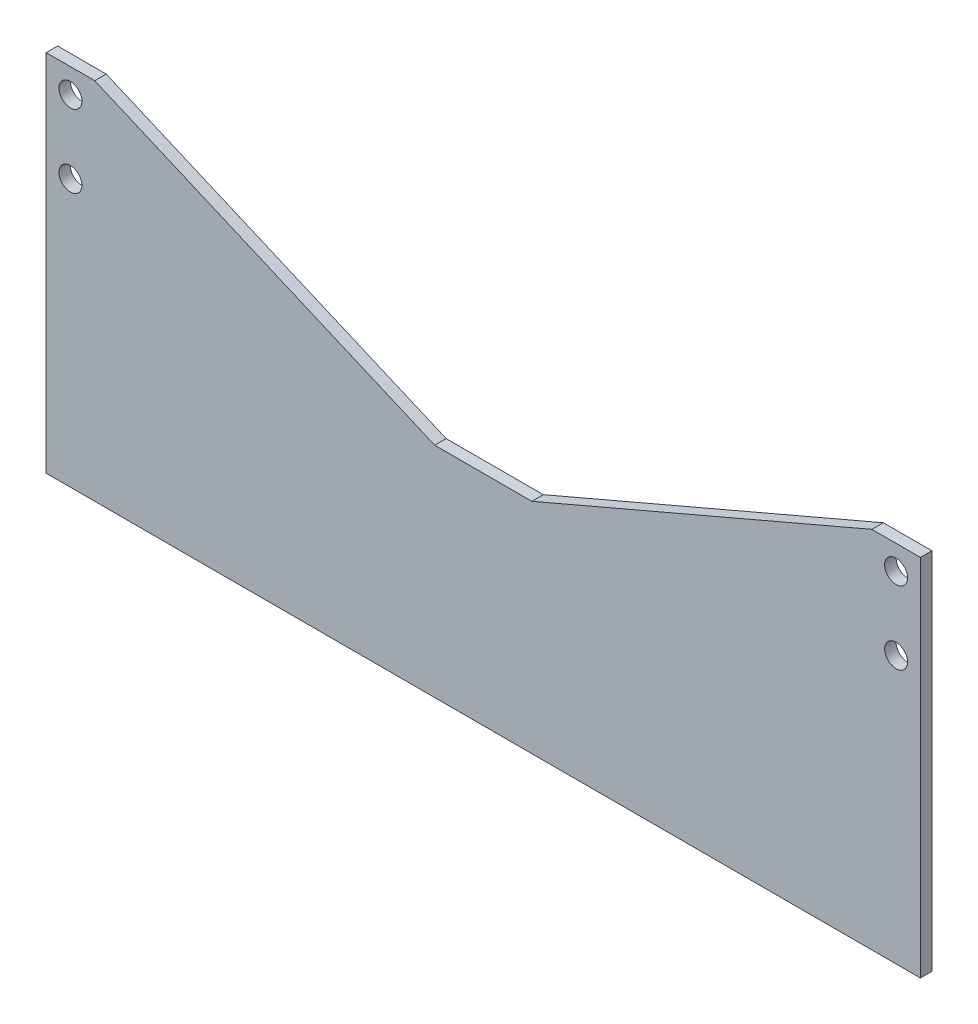
ISO-10303-21;
HEADER;
FILE_DESCRIPTION(('STEP AP214'),'2;1');
FILE_NAME('part.step','',(''),(''),'','','');
FILE_SCHEMA(('AUTOMOTIVE_DESIGN { 1 0 10303 214 1 1 1 1 }'));
ENDSEC;
DATA;
#1=APPLICATION_CONTEXT('core data for automotive mechanical design processes');
#2=APPLICATION_PROTOCOL_DEFINITION('international standard','automotive_design',2000,#1);
#3=PRODUCT_CONTEXT('',#1,'mechanical');
#4=PRODUCT('Part','Part','',(#3));
#5=PRODUCT_RELATED_PRODUCT_CATEGORY('part','',(#4));
#6=PRODUCT_DEFINITION_FORMATION('','',#4);
#7=PRODUCT_DEFINITION_CONTEXT('part definition',#1,'design');
#8=PRODUCT_DEFINITION('design','',#6,#7);
#9=PRODUCT_DEFINITION_SHAPE('','',#8);
#10=(LENGTH_UNIT() NAMED_UNIT(*) SI_UNIT(.MILLI.,.METRE.));
#11=(NAMED_UNIT(*) PLANE_ANGLE_UNIT() SI_UNIT($,.RADIAN.));
#12=(NAMED_UNIT(*) SI_UNIT($,.STERADIAN.) SOLID_ANGLE_UNIT());
#13=UNCERTAINTY_MEASURE_WITH_UNIT(LENGTH_MEASURE(1.E-05),#10,'distance_accuracy_value','');
#14=(GEOMETRIC_REPRESENTATION_CONTEXT(3) GLOBAL_UNCERTAINTY_ASSIGNED_CONTEXT((#13)) GLOBAL_UNIT_ASSIGNED_CONTEXT((#10,
#11,#12)) REPRESENTATION_CONTEXT('',''));
#15=CARTESIAN_POINT('',(0.,0.,0.));
#16=DIRECTION('',(0.,0.,1.));
#17=DIRECTION('',(1.,0.,0.));
#18=AXIS2_PLACEMENT_3D('',#15,#16,#17);
#19=CARTESIAN_POINT('',(0.,0.,0.75));
#20=DIRECTION('',(0.,0.,1.));
#21=DIRECTION('',(1.,0.,0.));
#22=AXIS2_PLACEMENT_3D('',#19,#20,#21);
#23=PLANE('',#22);
#24=CARTESIAN_POINT('',(-53.975,20.6375,0.75));
#25=DIRECTION('',(0.,0.,1.));
#26=DIRECTION('',(1.,0.,0.));
#27=AXIS2_PLACEMENT_3D('',#24,#25,#26);
#28=CIRCLE('',#27,1.5);
#29=CARTESIAN_POINT('',(-52.475,20.6375,0.75));
#30=VERTEX_POINT('',#29);
#31=EDGE_CURVE('E190',#30,#30,#28,.T.);
#32=ORIENTED_EDGE('',*,*,#31,.F.);
#33=EDGE_LOOP('',(#32));
#34=FACE_BOUND('',#33,.T.);
#35=CARTESIAN_POINT('',(53.975,20.6375,0.75));
#36=DIRECTION('',(0.,0.,1.));
#37=DIRECTION('',(1.,0.,0.));
#38=AXIS2_PLACEMENT_3D('',#35,#36,#37);
#39=CIRCLE('',#38,1.5);
#40=CARTESIAN_POINT('',(55.475,20.6375,0.75));
#41=VERTEX_POINT('',#40);
#42=EDGE_CURVE('E136',#41,#41,#39,.T.);
#43=ORIENTED_EDGE('',*,*,#42,.F.);
#44=EDGE_LOOP('',(#43));
#45=FACE_BOUND('',#44,.T.);
#46=DIRECTION('',(-1.,0.,0.));
#47=VECTOR('',#46,1.);
#48=CARTESIAN_POINT('',(50.8,23.8125,0.75));
#49=LINE('',#48,#47);
#50=CARTESIAN_POINT('',(57.15,23.8125,0.75));
#51=VERTEX_POINT('',#50);
#52=CARTESIAN_POINT('',(50.8,23.8125,0.75));
#53=VERTEX_POINT('',#52);
#54=EDGE_CURVE('E147',#51,#53,#49,.T.);
#55=ORIENTED_EDGE('',*,*,#54,.T.);
#56=DIRECTION('',(-0.919145030018058,-0.393919298579168,0.));
#57=VECTOR('',#56,1.);
#58=CARTESIAN_POINT('',(6.35,4.7625,0.75));
#59=LINE('',#58,#57);
#60=CARTESIAN_POINT('',(6.35,4.7625,0.75));
#61=VERTEX_POINT('',#60);
#62=EDGE_CURVE('E95',#53,#61,#59,.T.);
#63=ORIENTED_EDGE('',*,*,#62,.T.);
#64=DIRECTION('',(-1.,0.,0.));
#65=VECTOR('',#64,1.);
#66=CARTESIAN_POINT('',(-6.35,4.7625,0.75));
#67=LINE('',#66,#65);
#68=CARTESIAN_POINT('',(-6.35,4.7625,0.75));
#69=VERTEX_POINT('',#68);
#70=EDGE_CURVE('E162',#61,#69,#67,.T.);
#71=ORIENTED_EDGE('',*,*,#70,.T.);
#72=DIRECTION('',(-0.919145030018058,0.393919298579168,0.));
#73=VECTOR('',#72,1.);
#74=CARTESIAN_POINT('',(-6.35,4.7625,0.75));
#75=LINE('',#74,#73);
#76=CARTESIAN_POINT('',(-50.8,23.8125,0.75));
#77=VERTEX_POINT('',#76);
#78=EDGE_CURVE('E175',#69,#77,#75,.T.);
#79=ORIENTED_EDGE('',*,*,#78,.T.);
#80=DIRECTION('',(-1.,0.,0.));
#81=VECTOR('',#80,1.);
#82=CARTESIAN_POINT('',(-57.15,23.8125,0.75));
#83=LINE('',#82,#81);
#84=CARTESIAN_POINT('',(-57.15,23.8125,0.75));
#85=VERTEX_POINT('',#84);
#86=EDGE_CURVE('E114',#77,#85,#83,.T.);
#87=ORIENTED_EDGE('',*,*,#86,.T.);
#88=DIRECTION('',(0.,-1.,0.));
#89=VECTOR('',#88,1.);
#90=CARTESIAN_POINT('',(-57.15,-23.8125,0.75));
#91=LINE('',#90,#89);
#92=CARTESIAN_POINT('',(-57.15,-23.8125,0.75));
#93=VERTEX_POINT('',#92);
#94=EDGE_CURVE('E108',#85,#93,#91,.T.);
#95=ORIENTED_EDGE('',*,*,#94,.T.);
#96=DIRECTION('',(1.,0.,0.));
#97=VECTOR('',#96,1.);
#98=CARTESIAN_POINT('',(-57.15,-23.8125,0.75));
#99=LINE('',#98,#97);
#100=CARTESIAN_POINT('',(57.15,-23.8125,0.75));
#101=VERTEX_POINT('',#100);
#102=EDGE_CURVE('E112',#93,#101,#99,.T.);
#103=ORIENTED_EDGE('',*,*,#102,.T.);
#104=DIRECTION('',(0.,1.,0.));
#105=VECTOR('',#104,1.);
#106=CARTESIAN_POINT('',(57.15,-23.8125,0.75));
#107=LINE('',#106,#105);
#108=EDGE_CURVE('E52',#101,#51,#107,.T.);
#109=ORIENTED_EDGE('',*,*,#108,.T.);
#110=EDGE_LOOP('',(#55,#63,#71,#79,#87,#95,#103,#109));
#111=FACE_BOUND('',#110,.T.);
#112=CARTESIAN_POINT('',(53.975,11.1125,0.75));
#113=DIRECTION('',(0.,0.,1.));
#114=DIRECTION('',(1.,0.,0.));
#115=AXIS2_PLACEMENT_3D('',#112,#113,#114);
#116=CIRCLE('',#115,1.5);
#117=CARTESIAN_POINT('',(55.475,11.1125,0.75));
#118=VERTEX_POINT('',#117);
#119=EDGE_CURVE('E184',#118,#118,#116,.T.);
#120=ORIENTED_EDGE('',*,*,#119,.F.);
#121=EDGE_LOOP('',(#120));
#122=FACE_BOUND('',#121,.T.);
#123=CARTESIAN_POINT('',(-53.975,11.1125,0.75));
#124=DIRECTION('',(0.,0.,1.));
#125=DIRECTION('',(1.,0.,0.));
#126=AXIS2_PLACEMENT_3D('',#123,#124,#125);
#127=CIRCLE('',#126,1.5);
#128=CARTESIAN_POINT('',(-52.475,11.1125,0.75));
#129=VERTEX_POINT('',#128);
#130=EDGE_CURVE('E196',#129,#129,#127,.T.);
#131=ORIENTED_EDGE('',*,*,#130,.F.);
#132=EDGE_LOOP('',(#131));
#133=FACE_BOUND('',#132,.T.);
#134=ADVANCED_FACE('F35',(#34,#45,#111,#122,#133),#23,.T.);
#135=CARTESIAN_POINT('',(0.,0.,-0.75));
#136=DIRECTION('',(0.,0.,1.));
#137=DIRECTION('',(1.,0.,0.));
#138=AXIS2_PLACEMENT_3D('',#135,#136,#137);
#139=PLANE('',#138);
#140=DIRECTION('',(-1.,0.,0.));
#141=VECTOR('',#140,1.);
#142=CARTESIAN_POINT('',(50.8,23.8125,-0.75));
#143=LINE('',#142,#141);
#144=CARTESIAN_POINT('',(57.15,23.8125,-0.75));
#145=VERTEX_POINT('',#144);
#146=CARTESIAN_POINT('',(50.8,23.8125,-0.75));
#147=VERTEX_POINT('',#146);
#148=EDGE_CURVE('E132',#145,#147,#143,.T.);
#149=ORIENTED_EDGE('',*,*,#148,.F.);
#150=DIRECTION('',(0.,1.,0.));
#151=VECTOR('',#150,1.);
#152=CARTESIAN_POINT('',(57.15,-23.8125,-0.75));
#153=LINE('',#152,#151);
#154=CARTESIAN_POINT('',(57.15,-23.8125,-0.75));
#155=VERTEX_POINT('',#154);
#156=EDGE_CURVE('E87',#155,#145,#153,.T.);
#157=ORIENTED_EDGE('',*,*,#156,.F.);
#158=DIRECTION('',(1.,0.,0.));
#159=VECTOR('',#158,1.);
#160=CARTESIAN_POINT('',(-57.15,-23.8125,-0.75));
#161=LINE('',#160,#159);
#162=CARTESIAN_POINT('',(-57.15,-23.8125,-0.75));
#163=VERTEX_POINT('',#162);
#164=EDGE_CURVE('E81',#163,#155,#161,.T.);
#165=ORIENTED_EDGE('',*,*,#164,.F.);
#166=DIRECTION('',(0.,-1.,0.));
#167=VECTOR('',#166,1.);
#168=CARTESIAN_POINT('',(-57.15,-23.8125,-0.75));
#169=LINE('',#168,#167);
#170=CARTESIAN_POINT('',(-57.15,23.8125,-0.75));
#171=VERTEX_POINT('',#170);
#172=EDGE_CURVE('E122',#171,#163,#169,.T.);
#173=ORIENTED_EDGE('',*,*,#172,.F.);
#174=DIRECTION('',(-1.,0.,0.));
#175=VECTOR('',#174,1.);
#176=CARTESIAN_POINT('',(-57.15,23.8125,-0.75));
#177=LINE('',#176,#175);
#178=CARTESIAN_POINT('',(-50.8,23.8125,-0.75));
#179=VERTEX_POINT('',#178);
#180=EDGE_CURVE('E142',#179,#171,#177,.T.);
#181=ORIENTED_EDGE('',*,*,#180,.F.);
#182=DIRECTION('',(-0.919145030018058,0.393919298579168,0.));
#183=VECTOR('',#182,1.);
#184=CARTESIAN_POINT('',(-6.35,4.7625,-0.75));
#185=LINE('',#184,#183);
#186=CARTESIAN_POINT('',(-6.35,4.7625,-0.75));
#187=VERTEX_POINT('',#186);
#188=EDGE_CURVE('E140',#187,#179,#185,.T.);
#189=ORIENTED_EDGE('',*,*,#188,.F.);
#190=DIRECTION('',(-1.,0.,0.));
#191=VECTOR('',#190,1.);
#192=CARTESIAN_POINT('',(-6.35,4.7625,-0.75));
#193=LINE('',#192,#191);
#194=CARTESIAN_POINT('',(6.35,4.7625,-0.75));
#195=VERTEX_POINT('',#194);
#196=EDGE_CURVE('E138',#195,#187,#193,.T.);
#197=ORIENTED_EDGE('',*,*,#196,.F.);
#198=DIRECTION('',(-0.919145030018058,-0.393919298579168,0.));
#199=VECTOR('',#198,1.);
#200=CARTESIAN_POINT('',(6.35,4.7625,-0.75));
#201=LINE('',#200,#199);
#202=EDGE_CURVE('E135',#147,#195,#201,.T.);
#203=ORIENTED_EDGE('',*,*,#202,.F.);
#204=EDGE_LOOP('',(#149,#157,#165,#173,#181,#189,#197,#203));
#205=FACE_BOUND('',#204,.T.);
#206=CARTESIAN_POINT('',(53.975,20.6375,-0.75));
#207=DIRECTION('',(0.,0.,1.));
#208=DIRECTION('',(1.,0.,0.));
#209=AXIS2_PLACEMENT_3D('',#206,#207,#208);
#210=CIRCLE('',#209,1.5);
#211=CARTESIAN_POINT('',(55.475,20.6375,-0.75));
#212=VERTEX_POINT('',#211);
#213=EDGE_CURVE('E181',#212,#212,#210,.T.);
#214=ORIENTED_EDGE('',*,*,#213,.T.);
#215=EDGE_LOOP('',(#214));
#216=FACE_BOUND('',#215,.T.);
#217=CARTESIAN_POINT('',(53.975,11.1125,-0.75));
#218=DIRECTION('',(0.,0.,1.));
#219=DIRECTION('',(1.,0.,0.));
#220=AXIS2_PLACEMENT_3D('',#217,#218,#219);
#221=CIRCLE('',#220,1.5);
#222=CARTESIAN_POINT('',(55.475,11.1125,-0.75));
#223=VERTEX_POINT('',#222);
#224=EDGE_CURVE('E187',#223,#223,#221,.T.);
#225=ORIENTED_EDGE('',*,*,#224,.T.);
#226=EDGE_LOOP('',(#225));
#227=FACE_BOUND('',#226,.T.);
#228=CARTESIAN_POINT('',(-53.975,20.6375,-0.75));
#229=DIRECTION('',(0.,0.,1.));
#230=DIRECTION('',(1.,0.,0.));
#231=AXIS2_PLACEMENT_3D('',#228,#229,#230);
#232=CIRCLE('',#231,1.5);
#233=CARTESIAN_POINT('',(-52.475,20.6375,-0.75));
#234=VERTEX_POINT('',#233);
#235=EDGE_CURVE('E193',#234,#234,#232,.T.);
#236=ORIENTED_EDGE('',*,*,#235,.T.);
#237=EDGE_LOOP('',(#236));
#238=FACE_BOUND('',#237,.T.);
#239=CARTESIAN_POINT('',(-53.975,11.1125,-0.75));
#240=DIRECTION('',(0.,0.,1.));
#241=DIRECTION('',(1.,0.,0.));
#242=AXIS2_PLACEMENT_3D('',#239,#240,#241);
#243=CIRCLE('',#242,1.5);
#244=CARTESIAN_POINT('',(-52.475,11.1125,-0.75));
#245=VERTEX_POINT('',#244);
#246=EDGE_CURVE('E199',#245,#245,#243,.T.);
#247=ORIENTED_EDGE('',*,*,#246,.T.);
#248=EDGE_LOOP('',(#247));
#249=FACE_BOUND('',#248,.T.);
#250=ADVANCED_FACE('F166',(#205,#216,#227,#238,#249),#139,.F.);
#251=CARTESIAN_POINT('',(50.8,23.8125,0.75));
#252=DIRECTION('',(0.,-1.,0.));
#253=DIRECTION('',(0.,0.,-1.));
#254=AXIS2_PLACEMENT_3D('',#251,#252,#253);
#255=PLANE('',#254);
#256=ORIENTED_EDGE('',*,*,#148,.T.);
#257=DIRECTION('',(0.,0.,-1.));
#258=VECTOR('',#257,1.);
#259=CARTESIAN_POINT('',(50.8,23.8125,0.75));
#260=LINE('',#259,#258);
#261=EDGE_CURVE('E11',#53,#147,#260,.T.);
#262=ORIENTED_EDGE('',*,*,#261,.F.);
#263=ORIENTED_EDGE('',*,*,#54,.F.);
#264=DIRECTION('',(0.,0.,-1.));
#265=VECTOR('',#264,1.);
#266=CARTESIAN_POINT('',(57.15,23.8125,0.75));
#267=LINE('',#266,#265);
#268=EDGE_CURVE('E128',#51,#145,#267,.T.);
#269=ORIENTED_EDGE('',*,*,#268,.T.);
#270=EDGE_LOOP('',(#256,#262,#263,#269));
#271=FACE_BOUND('',#270,.T.);
#272=ADVANCED_FACE('F37',(#271),#255,.F.);
#273=CARTESIAN_POINT('',(6.35,4.7625,0.75));
#274=DIRECTION('',(0.393919298579168,-0.919145030018058,0.));
#275=DIRECTION('',(0.919145030018058,0.393919298579168,0.));
#276=AXIS2_PLACEMENT_3D('',#273,#274,#275);
#277=PLANE('',#276);
#278=ORIENTED_EDGE('',*,*,#202,.T.);
#279=DIRECTION('',(0.,0.,-1.));
#280=VECTOR('',#279,1.);
#281=CARTESIAN_POINT('',(6.35,4.7625,0.75));
#282=LINE('',#281,#280);
#283=EDGE_CURVE('E44',#61,#195,#282,.T.);
#284=ORIENTED_EDGE('',*,*,#283,.F.);
#285=ORIENTED_EDGE('',*,*,#62,.F.);
#286=ORIENTED_EDGE('',*,*,#261,.T.);
#287=EDGE_LOOP('',(#278,#284,#285,#286));
#288=FACE_BOUND('',#287,.T.);
#289=ADVANCED_FACE('F233',(#288),#277,.F.);
#290=CARTESIAN_POINT('',(-6.35,4.7625,0.75));
#291=DIRECTION('',(0.,-1.,0.));
#292=DIRECTION('',(1.,0.,0.));
#293=AXIS2_PLACEMENT_3D('',#290,#291,#292);
#294=PLANE('',#293);
#295=ORIENTED_EDGE('',*,*,#196,.T.);
#296=DIRECTION('',(0.,0.,-1.));
#297=VECTOR('',#296,1.);
#298=CARTESIAN_POINT('',(-6.35,4.7625,0.75));
#299=LINE('',#298,#297);
#300=EDGE_CURVE('E154',#69,#187,#299,.T.);
#301=ORIENTED_EDGE('',*,*,#300,.F.);
#302=ORIENTED_EDGE('',*,*,#70,.F.);
#303=ORIENTED_EDGE('',*,*,#283,.T.);
#304=EDGE_LOOP('',(#295,#301,#302,#303));
#305=FACE_BOUND('',#304,.T.);
#306=ADVANCED_FACE('F160',(#305),#294,.F.);
#307=CARTESIAN_POINT('',(-6.35,4.7625,0.75));
#308=DIRECTION('',(-0.393919298579168,-0.919145030018058,0.));
#309=DIRECTION('',(0.919145030018058,-0.393919298579168,0.));
#310=AXIS2_PLACEMENT_3D('',#307,#308,#309);
#311=PLANE('',#310);
#312=ORIENTED_EDGE('',*,*,#188,.T.);
#313=DIRECTION('',(0.,0.,-1.));
#314=VECTOR('',#313,1.);
#315=CARTESIAN_POINT('',(-50.8,23.8125,0.75));
#316=LINE('',#315,#314);
#317=EDGE_CURVE('E151',#77,#179,#316,.T.);
#318=ORIENTED_EDGE('',*,*,#317,.F.);
#319=ORIENTED_EDGE('',*,*,#78,.F.);
#320=ORIENTED_EDGE('',*,*,#300,.T.);
#321=EDGE_LOOP('',(#312,#318,#319,#320));
#322=FACE_BOUND('',#321,.T.);
#323=ADVANCED_FACE('F171',(#322),#311,.F.);
#324=CARTESIAN_POINT('',(-57.15,23.8125,0.75));
#325=DIRECTION('',(0.,-1.,0.));
#326=DIRECTION('',(0.,0.,-1.));
#327=AXIS2_PLACEMENT_3D('',#324,#325,#326);
#328=PLANE('',#327);
#329=ORIENTED_EDGE('',*,*,#180,.T.);
#330=DIRECTION('',(0.,0.,-1.));
#331=VECTOR('',#330,1.);
#332=CARTESIAN_POINT('',(-57.15,23.8125,0.75));
#333=LINE('',#332,#331);
#334=EDGE_CURVE('E123',#85,#171,#333,.T.);
#335=ORIENTED_EDGE('',*,*,#334,.F.);
#336=ORIENTED_EDGE('',*,*,#86,.F.);
#337=ORIENTED_EDGE('',*,*,#317,.T.);
#338=EDGE_LOOP('',(#329,#335,#336,#337));
#339=FACE_BOUND('',#338,.T.);
#340=ADVANCED_FACE('F174',(#339),#328,.F.);
#341=CARTESIAN_POINT('',(-57.15,-23.8125,0.75));
#342=DIRECTION('',(1.,0.,0.));
#343=DIRECTION('',(0.,0.,-1.));
#344=AXIS2_PLACEMENT_3D('',#341,#342,#343);
#345=PLANE('',#344);
#346=ORIENTED_EDGE('',*,*,#172,.T.);
#347=DIRECTION('',(0.,0.,-1.));
#348=VECTOR('',#347,1.);
#349=CARTESIAN_POINT('',(-57.15,-23.8125,0.75));
#350=LINE('',#349,#348);
#351=EDGE_CURVE('E119',#93,#163,#350,.T.);
#352=ORIENTED_EDGE('',*,*,#351,.F.);
#353=ORIENTED_EDGE('',*,*,#94,.F.);
#354=ORIENTED_EDGE('',*,*,#334,.T.);
#355=EDGE_LOOP('',(#346,#352,#353,#354));
#356=FACE_BOUND('',#355,.T.);
#357=ADVANCED_FACE('F120',(#356),#345,.F.);
#358=CARTESIAN_POINT('',(-57.15,-23.8125,0.75));
#359=DIRECTION('',(0.,1.,0.));
#360=DIRECTION('',(0.,0.,1.));
#361=AXIS2_PLACEMENT_3D('',#358,#359,#360);
#362=PLANE('',#361);
#363=ORIENTED_EDGE('',*,*,#164,.T.);
#364=DIRECTION('',(0.,0.,-1.));
#365=VECTOR('',#364,1.);
#366=CARTESIAN_POINT('',(57.15,-23.8125,0.75));
#367=LINE('',#366,#365);
#368=EDGE_CURVE('E124',#101,#155,#367,.T.);
#369=ORIENTED_EDGE('',*,*,#368,.F.);
#370=ORIENTED_EDGE('',*,*,#102,.F.);
#371=ORIENTED_EDGE('',*,*,#351,.T.);
#372=EDGE_LOOP('',(#363,#369,#370,#371));
#373=FACE_BOUND('',#372,.T.);
#374=ADVANCED_FACE('F126',(#373),#362,.F.);
#375=CARTESIAN_POINT('',(57.15,-23.8125,0.75));
#376=DIRECTION('',(-1.,0.,0.));
#377=DIRECTION('',(0.,0.,1.));
#378=AXIS2_PLACEMENT_3D('',#375,#376,#377);
#379=PLANE('',#378);
#380=ORIENTED_EDGE('',*,*,#156,.T.);
#381=ORIENTED_EDGE('',*,*,#268,.F.);
#382=ORIENTED_EDGE('',*,*,#108,.F.);
#383=ORIENTED_EDGE('',*,*,#368,.T.);
#384=EDGE_LOOP('',(#380,#381,#382,#383));
#385=FACE_BOUND('',#384,.T.);
#386=ADVANCED_FACE('F221',(#385),#379,.F.);
#387=CARTESIAN_POINT('',(53.975,20.6375,0.75));
#388=DIRECTION('',(0.,0.,-1.));
#389=DIRECTION('',(-1.,0.,0.));
#390=AXIS2_PLACEMENT_3D('',#387,#388,#389);
#391=CYLINDRICAL_SURFACE('',#390,1.5);
#392=ORIENTED_EDGE('',*,*,#42,.T.);
#393=EDGE_LOOP('',(#392));
#394=FACE_BOUND('',#393,.T.);
#395=ORIENTED_EDGE('',*,*,#213,.F.);
#396=EDGE_LOOP('',(#395));
#397=FACE_BOUND('',#396,.T.);
#398=ADVANCED_FACE('F218',(#394,#397),#391,.F.);
#399=CARTESIAN_POINT('',(53.975,11.1125,0.75));
#400=DIRECTION('',(0.,0.,-1.));
#401=DIRECTION('',(-1.,0.,0.));
#402=AXIS2_PLACEMENT_3D('',#399,#400,#401);
#403=CYLINDRICAL_SURFACE('',#402,1.5);
#404=ORIENTED_EDGE('',*,*,#119,.T.);
#405=EDGE_LOOP('',(#404));
#406=FACE_BOUND('',#405,.T.);
#407=ORIENTED_EDGE('',*,*,#224,.F.);
#408=EDGE_LOOP('',(#407));
#409=FACE_BOUND('',#408,.T.);
#410=ADVANCED_FACE('F297',(#406,#409),#403,.F.);
#411=CARTESIAN_POINT('',(-53.975,20.6375,0.75));
#412=DIRECTION('',(0.,0.,-1.));
#413=DIRECTION('',(-1.,0.,0.));
#414=AXIS2_PLACEMENT_3D('',#411,#412,#413);
#415=CYLINDRICAL_SURFACE('',#414,1.5);
#416=ORIENTED_EDGE('',*,*,#31,.T.);
#417=EDGE_LOOP('',(#416));
#418=FACE_BOUND('',#417,.T.);
#419=ORIENTED_EDGE('',*,*,#235,.F.);
#420=EDGE_LOOP('',(#419));
#421=FACE_BOUND('',#420,.T.);
#422=ADVANCED_FACE('F305',(#418,#421),#415,.F.);
#423=CARTESIAN_POINT('',(-53.975,11.1125,0.75));
#424=DIRECTION('',(0.,0.,-1.));
#425=DIRECTION('',(-1.,0.,0.));
#426=AXIS2_PLACEMENT_3D('',#423,#424,#425);
#427=CYLINDRICAL_SURFACE('',#426,1.5);
#428=ORIENTED_EDGE('',*,*,#130,.T.);
#429=EDGE_LOOP('',(#428));
#430=FACE_BOUND('',#429,.T.);
#431=ORIENTED_EDGE('',*,*,#246,.F.);
#432=EDGE_LOOP('',(#431));
#433=FACE_BOUND('',#432,.T.);
#434=ADVANCED_FACE('F205',(#430,#433),#427,.F.);
#435=CLOSED_SHELL('',(#134,#250,#272,#289,#306,#323,#340,#357,#374,#386,#398,#410,#422,#434));
#436=MANIFOLD_SOLID_BREP('B2',#435);
#437=ADVANCED_BREP_SHAPE_REPRESENTATION('',(#18,#436),#14);
#438=SHAPE_DEFINITION_REPRESENTATION(#9,#437);
ENDSEC;
END-ISO-10303-21;
